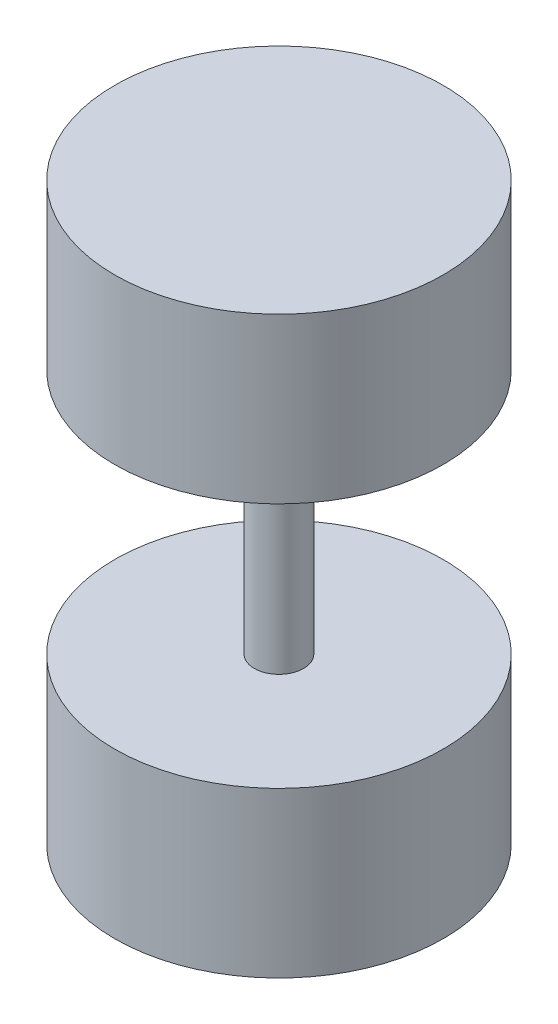
ISO-10303-21;
HEADER;
FILE_DESCRIPTION(('STEP AP214'),'2;1');
FILE_NAME('part.step','',(''),(''),'','','');
FILE_SCHEMA(('AUTOMOTIVE_DESIGN { 1 0 10303 214 1 1 1 1 }'));
ENDSEC;
DATA;
#1=APPLICATION_CONTEXT('core data for automotive mechanical design processes');
#2=APPLICATION_PROTOCOL_DEFINITION('international standard','automotive_design',2000,#1);
#3=PRODUCT_CONTEXT('',#1,'mechanical');
#4=PRODUCT('Part','Part','',(#3));
#5=PRODUCT_RELATED_PRODUCT_CATEGORY('part','',(#4));
#6=PRODUCT_DEFINITION_FORMATION('','',#4);
#7=PRODUCT_DEFINITION_CONTEXT('part definition',#1,'design');
#8=PRODUCT_DEFINITION('design','',#6,#7);
#9=PRODUCT_DEFINITION_SHAPE('','',#8);
#10=(LENGTH_UNIT() NAMED_UNIT(*) SI_UNIT(.MILLI.,.METRE.));
#11=(NAMED_UNIT(*) PLANE_ANGLE_UNIT() SI_UNIT($,.RADIAN.));
#12=(NAMED_UNIT(*) SI_UNIT($,.STERADIAN.) SOLID_ANGLE_UNIT());
#13=UNCERTAINTY_MEASURE_WITH_UNIT(LENGTH_MEASURE(1.E-05),#10,'distance_accuracy_value','');
#14=(GEOMETRIC_REPRESENTATION_CONTEXT(3) GLOBAL_UNCERTAINTY_ASSIGNED_CONTEXT((#13)) GLOBAL_UNIT_ASSIGNED_CONTEXT((#10,
#11,#12)) REPRESENTATION_CONTEXT('',''));
#15=CARTESIAN_POINT('',(0.,0.,0.));
#16=DIRECTION('',(0.,0.,1.));
#17=DIRECTION('',(1.,0.,0.));
#18=AXIS2_PLACEMENT_3D('',#15,#16,#17);
#19=CARTESIAN_POINT('',(0.,10.,0.));
#20=DIRECTION('',(0.,-1.,0.));
#21=DIRECTION('',(0.,0.,-1.));
#22=AXIS2_PLACEMENT_3D('',#19,#20,#21);
#23=CYLINDRICAL_SURFACE('',#22,10.);
#24=CARTESIAN_POINT('',(0.,10.,0.));
#25=DIRECTION('',(0.,1.,0.));
#26=DIRECTION('',(0.,0.,1.));
#27=AXIS2_PLACEMENT_3D('',#24,#25,#26);
#28=CIRCLE('',#27,10.);
#29=CARTESIAN_POINT('',(0.,10.,10.));
#30=VERTEX_POINT('',#29);
#31=EDGE_CURVE('E46',#30,#30,#28,.T.);
#32=ORIENTED_EDGE('',*,*,#31,.F.);
#33=EDGE_LOOP('',(#32));
#34=FACE_BOUND('',#33,.T.);
#35=CARTESIAN_POINT('',(0.,0.,0.));
#36=DIRECTION('',(0.,1.,0.));
#37=DIRECTION('',(0.,0.,1.));
#38=AXIS2_PLACEMENT_3D('',#35,#36,#37);
#39=CIRCLE('',#38,10.);
#40=CARTESIAN_POINT('',(0.,0.,10.));
#41=VERTEX_POINT('',#40);
#42=EDGE_CURVE('E41',#41,#41,#39,.T.);
#43=ORIENTED_EDGE('',*,*,#42,.T.);
#44=EDGE_LOOP('',(#43));
#45=FACE_BOUND('',#44,.T.);
#46=ADVANCED_FACE('F38',(#34,#45),#23,.T.);
#47=CARTESIAN_POINT('',(0.,10.,0.));
#48=DIRECTION('',(0.,1.,0.));
#49=DIRECTION('',(0.,0.,1.));
#50=AXIS2_PLACEMENT_3D('',#47,#48,#49);
#51=PLANE('',#50);
#52=CARTESIAN_POINT('',(0.,10.,0.));
#53=DIRECTION('',(0.,1.,0.));
#54=DIRECTION('',(0.,0.,1.));
#55=AXIS2_PLACEMENT_3D('',#52,#53,#54);
#56=CIRCLE('',#55,1.5);
#57=CARTESIAN_POINT('',(0.,10.,1.5));
#58=VERTEX_POINT('',#57);
#59=EDGE_CURVE('E11',#58,#58,#56,.T.);
#60=ORIENTED_EDGE('',*,*,#59,.F.);
#61=EDGE_LOOP('',(#60));
#62=FACE_BOUND('',#61,.T.);
#63=ORIENTED_EDGE('',*,*,#31,.T.);
#64=EDGE_LOOP('',(#63));
#65=FACE_BOUND('',#64,.T.);
#66=ADVANCED_FACE('F159',(#62,#65),#51,.T.);
#67=CARTESIAN_POINT('',(0.,0.,0.));
#68=DIRECTION('',(0.,1.,0.));
#69=DIRECTION('',(0.,0.,1.));
#70=AXIS2_PLACEMENT_3D('',#67,#68,#69);
#71=PLANE('',#70);
#72=DIRECTION('',(-0.5,0.,0.866025403784439));
#73=VECTOR('',#72,1.);
#74=CARTESIAN_POINT('',(7.,0.,0.));
#75=LINE('',#74,#73);
#76=CARTESIAN_POINT('',(7.,0.,0.));
#77=VERTEX_POINT('',#76);
#78=CARTESIAN_POINT('',(3.5,0.,6.06217782649107));
#79=VERTEX_POINT('',#78);
#80=EDGE_CURVE('E128',#77,#79,#75,.T.);
#81=ORIENTED_EDGE('',*,*,#80,.F.);
#82=DIRECTION('',(0.5,0.,0.866025403784439));
#83=VECTOR('',#82,1.);
#84=CARTESIAN_POINT('',(3.5,0.,-6.06217782649107));
#85=LINE('',#84,#83);
#86=CARTESIAN_POINT('',(3.5,0.,-6.06217782649107));
#87=VERTEX_POINT('',#86);
#88=EDGE_CURVE('E54',#87,#77,#85,.T.);
#89=ORIENTED_EDGE('',*,*,#88,.F.);
#90=DIRECTION('',(1.,0.,0.));
#91=VECTOR('',#90,1.);
#92=CARTESIAN_POINT('',(-3.5,0.,-6.06217782649107));
#93=LINE('',#92,#91);
#94=CARTESIAN_POINT('',(-3.5,0.,-6.06217782649107));
#95=VERTEX_POINT('',#94);
#96=EDGE_CURVE('E138',#95,#87,#93,.T.);
#97=ORIENTED_EDGE('',*,*,#96,.F.);
#98=DIRECTION('',(0.5,0.,-0.866025403784439));
#99=VECTOR('',#98,1.);
#100=CARTESIAN_POINT('',(-7.,0.,0.));
#101=LINE('',#100,#99);
#102=CARTESIAN_POINT('',(-7.,0.,0.));
#103=VERTEX_POINT('',#102);
#104=EDGE_CURVE('E136',#103,#95,#101,.T.);
#105=ORIENTED_EDGE('',*,*,#104,.F.);
#106=DIRECTION('',(-0.5,0.,-0.866025403784439));
#107=VECTOR('',#106,1.);
#108=CARTESIAN_POINT('',(-3.5,0.,6.06217782649107));
#109=LINE('',#108,#107);
#110=CARTESIAN_POINT('',(-3.5,0.,6.06217782649107));
#111=VERTEX_POINT('',#110);
#112=EDGE_CURVE('E102',#111,#103,#109,.T.);
#113=ORIENTED_EDGE('',*,*,#112,.F.);
#114=DIRECTION('',(-1.,0.,0.));
#115=VECTOR('',#114,1.);
#116=CARTESIAN_POINT('',(3.5,0.,6.06217782649107));
#117=LINE('',#116,#115);
#118=EDGE_CURVE('E132',#79,#111,#117,.T.);
#119=ORIENTED_EDGE('',*,*,#118,.F.);
#120=EDGE_LOOP('',(#81,#89,#97,#105,#113,#119));
#121=FACE_BOUND('',#120,.T.);
#122=ORIENTED_EDGE('',*,*,#42,.F.);
#123=EDGE_LOOP('',(#122));
#124=FACE_BOUND('',#123,.T.);
#125=ADVANCED_FACE('F156',(#121,#124),#71,.F.);
#126=CARTESIAN_POINT('',(0.,25.,0.));
#127=DIRECTION('',(0.,-1.,0.));
#128=DIRECTION('',(0.,0.,-1.));
#129=AXIS2_PLACEMENT_3D('',#126,#127,#128);
#130=CYLINDRICAL_SURFACE('',#129,1.5);
#131=CARTESIAN_POINT('',(0.,25.,0.));
#132=DIRECTION('',(0.,1.,0.));
#133=DIRECTION('',(0.,0.,1.));
#134=AXIS2_PLACEMENT_3D('',#131,#132,#133);
#135=CIRCLE('',#134,1.5);
#136=CARTESIAN_POINT('',(0.,25.,1.5));
#137=VERTEX_POINT('',#136);
#138=EDGE_CURVE('E142',#137,#137,#135,.T.);
#139=ORIENTED_EDGE('',*,*,#138,.F.);
#140=EDGE_LOOP('',(#139));
#141=FACE_BOUND('',#140,.T.);
#142=ORIENTED_EDGE('',*,*,#59,.T.);
#143=EDGE_LOOP('',(#142));
#144=FACE_BOUND('',#143,.T.);
#145=ADVANCED_FACE('F158',(#141,#144),#130,.T.);
#146=CARTESIAN_POINT('',(3.5,8.,-6.06217782649107));
#147=DIRECTION('',(0.866025403784439,0.,-0.5));
#148=DIRECTION('',(-0.5,0.,-0.866025403784439));
#149=AXIS2_PLACEMENT_3D('',#146,#147,#148);
#150=PLANE('',#149);
#151=ORIENTED_EDGE('',*,*,#88,.T.);
#152=DIRECTION('',(0.,-1.,0.));
#153=VECTOR('',#152,1.);
#154=CARTESIAN_POINT('',(7.,8.,0.));
#155=LINE('',#154,#153);
#156=CARTESIAN_POINT('',(7.,8.,0.));
#157=VERTEX_POINT('',#156);
#158=EDGE_CURVE('E84',#157,#77,#155,.T.);
#159=ORIENTED_EDGE('',*,*,#158,.F.);
#160=DIRECTION('',(0.5,0.,0.866025403784439));
#161=VECTOR('',#160,1.);
#162=CARTESIAN_POINT('',(3.5,8.,-6.06217782649107));
#163=LINE('',#162,#161);
#164=CARTESIAN_POINT('',(3.5,8.,-6.06217782649107));
#165=VERTEX_POINT('',#164);
#166=EDGE_CURVE('E140',#165,#157,#163,.T.);
#167=ORIENTED_EDGE('',*,*,#166,.F.);
#168=DIRECTION('',(0.,-1.,0.));
#169=VECTOR('',#168,1.);
#170=CARTESIAN_POINT('',(3.5,8.,-6.06217782649107));
#171=LINE('',#170,#169);
#172=EDGE_CURVE('E62',#165,#87,#171,.T.);
#173=ORIENTED_EDGE('',*,*,#172,.T.);
#174=EDGE_LOOP('',(#151,#159,#167,#173));
#175=FACE_BOUND('',#174,.T.);
#176=ADVANCED_FACE('F165',(#175),#150,.F.);
#177=CARTESIAN_POINT('',(-3.5,8.,-6.06217782649107));
#178=DIRECTION('',(0.,0.,-1.));
#179=DIRECTION('',(-1.,0.,0.));
#180=AXIS2_PLACEMENT_3D('',#177,#178,#179);
#181=PLANE('',#180);
#182=ORIENTED_EDGE('',*,*,#96,.T.);
#183=ORIENTED_EDGE('',*,*,#172,.F.);
#184=DIRECTION('',(1.,0.,0.));
#185=VECTOR('',#184,1.);
#186=CARTESIAN_POINT('',(-3.5,8.,-6.06217782649107));
#187=LINE('',#186,#185);
#188=CARTESIAN_POINT('',(-3.5,8.,-6.06217782649107));
#189=VERTEX_POINT('',#188);
#190=EDGE_CURVE('E114',#189,#165,#187,.T.);
#191=ORIENTED_EDGE('',*,*,#190,.F.);
#192=DIRECTION('',(0.,-1.,0.));
#193=VECTOR('',#192,1.);
#194=CARTESIAN_POINT('',(-3.5,8.,-6.06217782649107));
#195=LINE('',#194,#193);
#196=EDGE_CURVE('E106',#189,#95,#195,.T.);
#197=ORIENTED_EDGE('',*,*,#196,.T.);
#198=EDGE_LOOP('',(#182,#183,#191,#197));
#199=FACE_BOUND('',#198,.T.);
#200=ADVANCED_FACE('F198',(#199),#181,.F.);
#201=CARTESIAN_POINT('',(-7.,8.,0.));
#202=DIRECTION('',(-0.866025403784439,0.,-0.5));
#203=DIRECTION('',(-0.5,0.,0.866025403784439));
#204=AXIS2_PLACEMENT_3D('',#201,#202,#203);
#205=PLANE('',#204);
#206=ORIENTED_EDGE('',*,*,#104,.T.);
#207=ORIENTED_EDGE('',*,*,#196,.F.);
#208=DIRECTION('',(0.5,0.,-0.866025403784439));
#209=VECTOR('',#208,1.);
#210=CARTESIAN_POINT('',(-7.,8.,0.));
#211=LINE('',#210,#209);
#212=CARTESIAN_POINT('',(-7.,8.,0.));
#213=VERTEX_POINT('',#212);
#214=EDGE_CURVE('E110',#213,#189,#211,.T.);
#215=ORIENTED_EDGE('',*,*,#214,.F.);
#216=DIRECTION('',(0.,-1.,0.));
#217=VECTOR('',#216,1.);
#218=CARTESIAN_POINT('',(-7.,8.,0.));
#219=LINE('',#218,#217);
#220=EDGE_CURVE('E95',#213,#103,#219,.T.);
#221=ORIENTED_EDGE('',*,*,#220,.T.);
#222=EDGE_LOOP('',(#206,#207,#215,#221));
#223=FACE_BOUND('',#222,.T.);
#224=ADVANCED_FACE('F111',(#223),#205,.F.);
#225=CARTESIAN_POINT('',(-3.5,8.,6.06217782649107));
#226=DIRECTION('',(-0.866025403784439,0.,0.5));
#227=DIRECTION('',(0.5,0.,0.866025403784439));
#228=AXIS2_PLACEMENT_3D('',#225,#226,#227);
#229=PLANE('',#228);
#230=ORIENTED_EDGE('',*,*,#112,.T.);
#231=ORIENTED_EDGE('',*,*,#220,.F.);
#232=DIRECTION('',(-0.5,0.,-0.866025403784439));
#233=VECTOR('',#232,1.);
#234=CARTESIAN_POINT('',(-3.5,8.,6.06217782649107));
#235=LINE('',#234,#233);
#236=CARTESIAN_POINT('',(-3.5,8.,6.06217782649107));
#237=VERTEX_POINT('',#236);
#238=EDGE_CURVE('E99',#237,#213,#235,.T.);
#239=ORIENTED_EDGE('',*,*,#238,.F.);
#240=DIRECTION('',(0.,-1.,0.));
#241=VECTOR('',#240,1.);
#242=CARTESIAN_POINT('',(-3.5,8.,6.06217782649107));
#243=LINE('',#242,#241);
#244=EDGE_CURVE('E107',#237,#111,#243,.T.);
#245=ORIENTED_EDGE('',*,*,#244,.T.);
#246=EDGE_LOOP('',(#230,#231,#239,#245));
#247=FACE_BOUND('',#246,.T.);
#248=ADVANCED_FACE('F97',(#247),#229,.F.);
#249=CARTESIAN_POINT('',(3.5,8.,6.06217782649107));
#250=DIRECTION('',(0.,0.,1.));
#251=DIRECTION('',(1.,0.,0.));
#252=AXIS2_PLACEMENT_3D('',#249,#250,#251);
#253=PLANE('',#252);
#254=ORIENTED_EDGE('',*,*,#118,.T.);
#255=ORIENTED_EDGE('',*,*,#244,.F.);
#256=DIRECTION('',(-1.,0.,0.));
#257=VECTOR('',#256,1.);
#258=CARTESIAN_POINT('',(3.5,8.,6.06217782649107));
#259=LINE('',#258,#257);
#260=CARTESIAN_POINT('',(3.5,8.,6.06217782649107));
#261=VERTEX_POINT('',#260);
#262=EDGE_CURVE('E120',#261,#237,#259,.T.);
#263=ORIENTED_EDGE('',*,*,#262,.F.);
#264=DIRECTION('',(0.,-1.,0.));
#265=VECTOR('',#264,1.);
#266=CARTESIAN_POINT('',(3.5,8.,6.06217782649107));
#267=LINE('',#266,#265);
#268=EDGE_CURVE('E145',#261,#79,#267,.T.);
#269=ORIENTED_EDGE('',*,*,#268,.T.);
#270=EDGE_LOOP('',(#254,#255,#263,#269));
#271=FACE_BOUND('',#270,.T.);
#272=ADVANCED_FACE('F223',(#271),#253,.F.);
#273=CARTESIAN_POINT('',(7.,8.,0.));
#274=DIRECTION('',(0.866025403784439,0.,0.5));
#275=DIRECTION('',(0.5,0.,-0.866025403784439));
#276=AXIS2_PLACEMENT_3D('',#273,#274,#275);
#277=PLANE('',#276);
#278=ORIENTED_EDGE('',*,*,#80,.T.);
#279=ORIENTED_EDGE('',*,*,#268,.F.);
#280=DIRECTION('',(-0.5,0.,0.866025403784439));
#281=VECTOR('',#280,1.);
#282=CARTESIAN_POINT('',(7.,8.,0.));
#283=LINE('',#282,#281);
#284=EDGE_CURVE('E122',#157,#261,#283,.T.);
#285=ORIENTED_EDGE('',*,*,#284,.F.);
#286=ORIENTED_EDGE('',*,*,#158,.T.);
#287=EDGE_LOOP('',(#278,#279,#285,#286));
#288=FACE_BOUND('',#287,.T.);
#289=ADVANCED_FACE('F232',(#288),#277,.F.);
#290=CARTESIAN_POINT('',(0.,8.,0.));
#291=DIRECTION('',(0.,-1.,0.));
#292=DIRECTION('',(0.,0.,-1.));
#293=AXIS2_PLACEMENT_3D('',#290,#291,#292);
#294=PLANE('',#293);
#295=ORIENTED_EDGE('',*,*,#166,.T.);
#296=ORIENTED_EDGE('',*,*,#284,.T.);
#297=ORIENTED_EDGE('',*,*,#262,.T.);
#298=ORIENTED_EDGE('',*,*,#238,.T.);
#299=ORIENTED_EDGE('',*,*,#214,.T.);
#300=ORIENTED_EDGE('',*,*,#190,.T.);
#301=EDGE_LOOP('',(#295,#296,#297,#298,#299,#300));
#302=FACE_BOUND('',#301,.T.);
#303=ADVANCED_FACE('F117',(#302),#294,.T.);
#304=CARTESIAN_POINT('',(0.,35.,0.));
#305=DIRECTION('',(0.,-1.,0.));
#306=DIRECTION('',(0.,0.,-1.));
#307=AXIS2_PLACEMENT_3D('',#304,#305,#306);
#308=CYLINDRICAL_SURFACE('',#307,10.);
#309=CARTESIAN_POINT('',(0.,35.,0.));
#310=DIRECTION('',(0.,1.,0.));
#311=DIRECTION('',(0.,0.,1.));
#312=AXIS2_PLACEMENT_3D('',#309,#310,#311);
#313=CIRCLE('',#312,10.);
#314=CARTESIAN_POINT('',(0.,35.,10.));
#315=VERTEX_POINT('',#314);
#316=EDGE_CURVE('E129',#315,#315,#313,.T.);
#317=ORIENTED_EDGE('',*,*,#316,.F.);
#318=EDGE_LOOP('',(#317));
#319=FACE_BOUND('',#318,.T.);
#320=CARTESIAN_POINT('',(0.,25.,0.));
#321=DIRECTION('',(0.,1.,0.));
#322=DIRECTION('',(0.,0.,1.));
#323=AXIS2_PLACEMENT_3D('',#320,#321,#322);
#324=CIRCLE('',#323,10.);
#325=CARTESIAN_POINT('',(0.,25.,10.));
#326=VERTEX_POINT('',#325);
#327=EDGE_CURVE('E288',#326,#326,#324,.T.);
#328=ORIENTED_EDGE('',*,*,#327,.T.);
#329=EDGE_LOOP('',(#328));
#330=FACE_BOUND('',#329,.T.);
#331=ADVANCED_FACE('F251',(#319,#330),#308,.T.);
#332=CARTESIAN_POINT('',(0.,35.,0.));
#333=DIRECTION('',(0.,1.,0.));
#334=DIRECTION('',(0.,0.,1.));
#335=AXIS2_PLACEMENT_3D('',#332,#333,#334);
#336=PLANE('',#335);
#337=ORIENTED_EDGE('',*,*,#316,.T.);
#338=EDGE_LOOP('',(#337));
#339=FACE_BOUND('',#338,.T.);
#340=ADVANCED_FACE('F260',(#339),#336,.T.);
#341=CARTESIAN_POINT('',(0.,25.,0.));
#342=DIRECTION('',(0.,1.,0.));
#343=DIRECTION('',(0.,0.,1.));
#344=AXIS2_PLACEMENT_3D('',#341,#342,#343);
#345=PLANE('',#344);
#346=ORIENTED_EDGE('',*,*,#138,.T.);
#347=EDGE_LOOP('',(#346));
#348=FACE_BOUND('',#347,.T.);
#349=ORIENTED_EDGE('',*,*,#327,.F.);
#350=EDGE_LOOP('',(#349));
#351=FACE_BOUND('',#350,.T.);
#352=ADVANCED_FACE('F270',(#348,#351),#345,.F.);
#353=CLOSED_SHELL('',(#46,#66,#125,#145,#176,#200,#224,#248,#272,#289,#303,#331,#340,#352));
#354=MANIFOLD_SOLID_BREP('B2',#353);
#355=ADVANCED_BREP_SHAPE_REPRESENTATION('',(#18,#354),#14);
#356=SHAPE_DEFINITION_REPRESENTATION(#9,#355);
ENDSEC;
END-ISO-10303-21;
